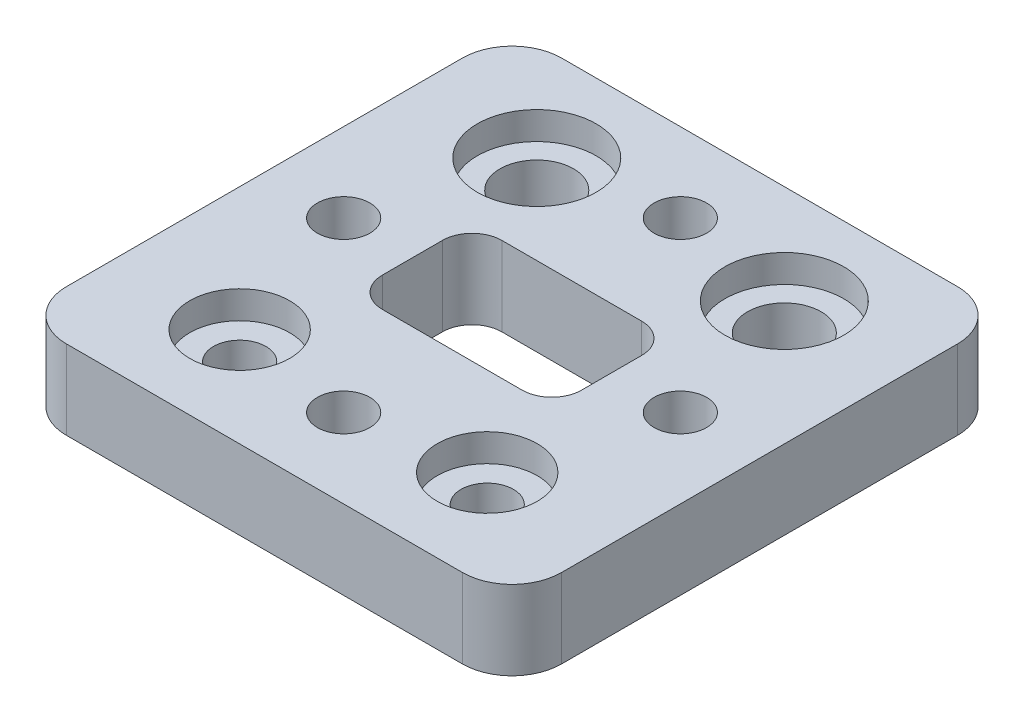
ISO-10303-21;
HEADER;
FILE_DESCRIPTION(('STEP AP214'),'2;1');
FILE_NAME('part.step','',(''),(''),'','','');
FILE_SCHEMA(('AUTOMOTIVE_DESIGN { 1 0 10303 214 1 1 1 1 }'));
ENDSEC;
DATA;
#1=APPLICATION_CONTEXT('core data for automotive mechanical design processes');
#2=APPLICATION_PROTOCOL_DEFINITION('international standard','automotive_design',2000,#1);
#3=PRODUCT_CONTEXT('',#1,'mechanical');
#4=PRODUCT('Part','Part','',(#3));
#5=PRODUCT_RELATED_PRODUCT_CATEGORY('part','',(#4));
#6=PRODUCT_DEFINITION_FORMATION('','',#4);
#7=PRODUCT_DEFINITION_CONTEXT('part definition',#1,'design');
#8=PRODUCT_DEFINITION('design','',#6,#7);
#9=PRODUCT_DEFINITION_SHAPE('','',#8);
#10=(LENGTH_UNIT() NAMED_UNIT(*) SI_UNIT(.MILLI.,.METRE.));
#11=(NAMED_UNIT(*) PLANE_ANGLE_UNIT() SI_UNIT($,.RADIAN.));
#12=(NAMED_UNIT(*) SI_UNIT($,.STERADIAN.) SOLID_ANGLE_UNIT());
#13=UNCERTAINTY_MEASURE_WITH_UNIT(LENGTH_MEASURE(1.E-05),#10,'distance_accuracy_value','');
#14=(GEOMETRIC_REPRESENTATION_CONTEXT(3) GLOBAL_UNCERTAINTY_ASSIGNED_CONTEXT((#13)) GLOBAL_UNIT_ASSIGNED_CONTEXT((#10,
#11,#12)) REPRESENTATION_CONTEXT('',''));
#15=CARTESIAN_POINT('',(0.,0.,0.));
#16=DIRECTION('',(0.,0.,1.));
#17=DIRECTION('',(1.,0.,0.));
#18=AXIS2_PLACEMENT_3D('',#15,#16,#17);
#19=CARTESIAN_POINT('',(-12.5,8.,15.));
#20=DIRECTION('',(0.,-1.,0.));
#21=DIRECTION('',(0.,0.,-1.));
#22=AXIS2_PLACEMENT_3D('',#19,#20,#21);
#23=CYLINDRICAL_SURFACE('',#22,2.65);
#24=CARTESIAN_POINT('',(-12.5,0.,15.));
#25=DIRECTION('',(0.,1.,0.));
#26=DIRECTION('',(0.,0.,1.));
#27=AXIS2_PLACEMENT_3D('',#24,#25,#26);
#28=CIRCLE('',#27,2.65);
#29=CARTESIAN_POINT('',(-12.5,0.,17.65));
#30=VERTEX_POINT('',#29);
#31=EDGE_CURVE('E266',#30,#30,#28,.T.);
#32=ORIENTED_EDGE('',*,*,#31,.F.);
#33=EDGE_LOOP('',(#32));
#34=FACE_BOUND('',#33,.T.);
#35=CARTESIAN_POINT('',(-12.5,5.2,15.));
#36=DIRECTION('',(0.,1.,0.));
#37=DIRECTION('',(0.,0.,1.));
#38=AXIS2_PLACEMENT_3D('',#35,#36,#37);
#39=CIRCLE('',#38,2.65);
#40=CARTESIAN_POINT('',(-12.5,5.2,17.65));
#41=VERTEX_POINT('',#40);
#42=EDGE_CURVE('E421',#41,#41,#39,.T.);
#43=ORIENTED_EDGE('',*,*,#42,.T.);
#44=EDGE_LOOP('',(#43));
#45=FACE_BOUND('',#44,.T.);
#46=ADVANCED_FACE('F58',(#34,#45),#23,.F.);
#47=CARTESIAN_POINT('',(12.5,8.,15.));
#48=DIRECTION('',(0.,-1.,0.));
#49=DIRECTION('',(0.,0.,-1.));
#50=AXIS2_PLACEMENT_3D('',#47,#48,#49);
#51=CYLINDRICAL_SURFACE('',#50,2.65);
#52=CARTESIAN_POINT('',(12.5,0.,15.));
#53=DIRECTION('',(0.,1.,0.));
#54=DIRECTION('',(0.,0.,1.));
#55=AXIS2_PLACEMENT_3D('',#52,#53,#54);
#56=CIRCLE('',#55,2.65);
#57=CARTESIAN_POINT('',(12.5,0.,17.65));
#58=VERTEX_POINT('',#57);
#59=EDGE_CURVE('E263',#58,#58,#56,.F.);
#60=ORIENTED_EDGE('',*,*,#59,.T.);
#61=EDGE_LOOP('',(#60));
#62=FACE_BOUND('',#61,.T.);
#63=CARTESIAN_POINT('',(12.5,5.2,15.));
#64=DIRECTION('',(0.,1.,0.));
#65=DIRECTION('',(0.,0.,1.));
#66=AXIS2_PLACEMENT_3D('',#63,#64,#65);
#67=CIRCLE('',#66,2.65);
#68=CARTESIAN_POINT('',(12.5,5.2,17.65));
#69=VERTEX_POINT('',#68);
#70=EDGE_CURVE('E416',#69,#69,#67,.T.);
#71=ORIENTED_EDGE('',*,*,#70,.T.);
#72=EDGE_LOOP('',(#71));
#73=FACE_BOUND('',#72,.T.);
#74=ADVANCED_FACE('F374',(#62,#73),#51,.F.);
#75=CARTESIAN_POINT('',(12.5,8.,-15.));
#76=DIRECTION('',(0.,-1.,0.));
#77=DIRECTION('',(0.,0.,-1.));
#78=AXIS2_PLACEMENT_3D('',#75,#76,#77);
#79=CYLINDRICAL_SURFACE('',#78,3.72000000000001);
#80=CARTESIAN_POINT('',(12.5,0.,-15.));
#81=DIRECTION('',(0.,1.,0.));
#82=DIRECTION('',(0.,0.,1.));
#83=AXIS2_PLACEMENT_3D('',#80,#81,#82);
#84=CIRCLE('',#83,3.72000000000001);
#85=CARTESIAN_POINT('',(12.5,0.,-11.28));
#86=VERTEX_POINT('',#85);
#87=EDGE_CURVE('E260',#86,#86,#84,.F.);
#88=ORIENTED_EDGE('',*,*,#87,.T.);
#89=EDGE_LOOP('',(#88));
#90=FACE_BOUND('',#89,.T.);
#91=CARTESIAN_POINT('',(12.5,5.2,-15.));
#92=DIRECTION('',(0.,1.,0.));
#93=DIRECTION('',(0.,0.,1.));
#94=AXIS2_PLACEMENT_3D('',#91,#92,#93);
#95=CIRCLE('',#94,3.72000000000001);
#96=CARTESIAN_POINT('',(12.5,5.2,-11.28));
#97=VERTEX_POINT('',#96);
#98=EDGE_CURVE('E398',#97,#97,#95,.T.);
#99=ORIENTED_EDGE('',*,*,#98,.T.);
#100=EDGE_LOOP('',(#99));
#101=FACE_BOUND('',#100,.T.);
#102=ADVANCED_FACE('F380',(#90,#101),#79,.F.);
#103=CARTESIAN_POINT('',(-12.5,8.,-15.));
#104=DIRECTION('',(0.,-1.,0.));
#105=DIRECTION('',(0.,0.,-1.));
#106=AXIS2_PLACEMENT_3D('',#103,#104,#105);
#107=CYLINDRICAL_SURFACE('',#106,3.72);
#108=CARTESIAN_POINT('',(-12.5,0.,-15.));
#109=DIRECTION('',(0.,1.,0.));
#110=DIRECTION('',(0.,0.,1.));
#111=AXIS2_PLACEMENT_3D('',#108,#109,#110);
#112=CIRCLE('',#111,3.72);
#113=CARTESIAN_POINT('',(-12.5,0.,-11.28));
#114=VERTEX_POINT('',#113);
#115=EDGE_CURVE('E269',#114,#114,#112,.T.);
#116=ORIENTED_EDGE('',*,*,#115,.F.);
#117=EDGE_LOOP('',(#116));
#118=FACE_BOUND('',#117,.T.);
#119=CARTESIAN_POINT('',(-12.5,5.2,-15.));
#120=DIRECTION('',(0.,1.,0.));
#121=DIRECTION('',(0.,0.,1.));
#122=AXIS2_PLACEMENT_3D('',#119,#120,#121);
#123=CIRCLE('',#122,3.72);
#124=CARTESIAN_POINT('',(-12.5,5.2,-11.28));
#125=VERTEX_POINT('',#124);
#126=EDGE_CURVE('E414',#125,#125,#123,.T.);
#127=ORIENTED_EDGE('',*,*,#126,.T.);
#128=EDGE_LOOP('',(#127));
#129=FACE_BOUND('',#128,.T.);
#130=ADVANCED_FACE('F386',(#118,#129),#107,.F.);
#131=CARTESIAN_POINT('',(-10.0602247248147,8.,0.));
#132=DIRECTION('',(-1.,0.,0.));
#133=DIRECTION('',(0.,0.,1.));
#134=AXIS2_PLACEMENT_3D('',#131,#132,#133);
#135=PLANE('',#134);
#136=DIRECTION('',(0.,0.,-1.));
#137=VECTOR('',#136,1.);
#138=CARTESIAN_POINT('',(-10.0602247248147,0.,0.));
#139=LINE('',#138,#137);
#140=CARTESIAN_POINT('',(-10.0602247248147,0.,3.03567090986811));
#141=VERTEX_POINT('',#140);
#142=CARTESIAN_POINT('',(-10.0602247248147,0.,-3.0356709098681));
#143=VERTEX_POINT('',#142);
#144=EDGE_CURVE('E242',#141,#143,#139,.T.);
#145=ORIENTED_EDGE('',*,*,#144,.T.);
#146=DIRECTION('',(0.,-1.,0.));
#147=VECTOR('',#146,1.);
#148=CARTESIAN_POINT('',(-10.0602247248147,8.,-3.0356709098681));
#149=LINE('',#148,#147);
#150=CARTESIAN_POINT('',(-10.0602247248147,8.,-3.0356709098681));
#151=VERTEX_POINT('',#150);
#152=EDGE_CURVE('E12',#151,#143,#149,.T.);
#153=ORIENTED_EDGE('',*,*,#152,.F.);
#154=DIRECTION('',(0.,0.,-1.));
#155=VECTOR('',#154,1.);
#156=CARTESIAN_POINT('',(-10.0602247248147,8.,0.));
#157=LINE('',#156,#155);
#158=CARTESIAN_POINT('',(-10.0602247248147,8.,3.03567090986811));
#159=VERTEX_POINT('',#158);
#160=EDGE_CURVE('E337',#159,#151,#157,.T.);
#161=ORIENTED_EDGE('',*,*,#160,.F.);
#162=DIRECTION('',(0.,-1.,0.));
#163=VECTOR('',#162,1.);
#164=CARTESIAN_POINT('',(-10.0602247248147,8.,3.03567090986811));
#165=LINE('',#164,#163);
#166=EDGE_CURVE('E273',#159,#141,#165,.T.);
#167=ORIENTED_EDGE('',*,*,#166,.T.);
#168=EDGE_LOOP('',(#145,#153,#161,#167));
#169=FACE_BOUND('',#168,.T.);
#170=ADVANCED_FACE('F354',(#169),#135,.F.);
#171=CARTESIAN_POINT('',(-7.06022472481465,8.,-3.03567090986813));
#172=DIRECTION('',(0.,-1.,0.));
#173=DIRECTION('',(0.,0.,-1.));
#174=AXIS2_PLACEMENT_3D('',#171,#172,#173);
#175=CYLINDRICAL_SURFACE('',#174,3.);
#176=CARTESIAN_POINT('',(-7.06022472481465,0.,-3.03567090986813));
#177=DIRECTION('',(0.,1.,0.));
#178=DIRECTION('',(0.,0.,1.));
#179=AXIS2_PLACEMENT_3D('',#176,#177,#178);
#180=CIRCLE('',#179,3.);
#181=CARTESIAN_POINT('',(-7.06022472481463,0.,-6.03567090986813));
#182=VERTEX_POINT('',#181);
#183=EDGE_CURVE('E245',#143,#182,#180,.F.);
#184=ORIENTED_EDGE('',*,*,#183,.T.);
#185=DIRECTION('',(0.,-1.,0.));
#186=VECTOR('',#185,1.);
#187=CARTESIAN_POINT('',(-7.06022472481463,8.,-6.03567090986813));
#188=LINE('',#187,#186);
#189=CARTESIAN_POINT('',(-7.06022472481463,8.,-6.03567090986813));
#190=VERTEX_POINT('',#189);
#191=EDGE_CURVE('E68',#190,#182,#188,.T.);
#192=ORIENTED_EDGE('',*,*,#191,.F.);
#193=CARTESIAN_POINT('',(-7.06022472481465,8.,-3.03567090986813));
#194=DIRECTION('',(0.,1.,0.));
#195=DIRECTION('',(0.,0.,1.));
#196=AXIS2_PLACEMENT_3D('',#193,#194,#195);
#197=CIRCLE('',#196,3.);
#198=EDGE_CURVE('E339',#151,#190,#197,.F.);
#199=ORIENTED_EDGE('',*,*,#198,.F.);
#200=ORIENTED_EDGE('',*,*,#152,.T.);
#201=EDGE_LOOP('',(#184,#192,#199,#200));
#202=FACE_BOUND('',#201,.T.);
#203=ADVANCED_FACE('F733',(#202),#175,.F.);
#204=CARTESIAN_POINT('',(0.,8.,-6.03567090986813));
#205=DIRECTION('',(0.,0.,-1.));
#206=DIRECTION('',(-1.,0.,0.));
#207=AXIS2_PLACEMENT_3D('',#204,#205,#206);
#208=PLANE('',#207);
#209=DIRECTION('',(1.,0.,0.));
#210=VECTOR('',#209,1.);
#211=CARTESIAN_POINT('',(0.,0.,-6.03567090986813));
#212=LINE('',#211,#210);
#213=CARTESIAN_POINT('',(7.06022472481462,0.,-6.03567090986813));
#214=VERTEX_POINT('',#213);
#215=EDGE_CURVE('E247',#182,#214,#212,.T.);
#216=ORIENTED_EDGE('',*,*,#215,.T.);
#217=DIRECTION('',(0.,-1.,0.));
#218=VECTOR('',#217,1.);
#219=CARTESIAN_POINT('',(7.06022472481462,8.,-6.03567090986813));
#220=LINE('',#219,#218);
#221=CARTESIAN_POINT('',(7.06022472481462,8.,-6.03567090986813));
#222=VERTEX_POINT('',#221);
#223=EDGE_CURVE('E279',#222,#214,#220,.T.);
#224=ORIENTED_EDGE('',*,*,#223,.F.);
#225=DIRECTION('',(1.,0.,0.));
#226=VECTOR('',#225,1.);
#227=CARTESIAN_POINT('',(0.,8.,-6.03567090986813));
#228=LINE('',#227,#226);
#229=EDGE_CURVE('E341',#190,#222,#228,.T.);
#230=ORIENTED_EDGE('',*,*,#229,.F.);
#231=ORIENTED_EDGE('',*,*,#191,.T.);
#232=EDGE_LOOP('',(#216,#224,#230,#231));
#233=FACE_BOUND('',#232,.T.);
#234=ADVANCED_FACE('F723',(#233),#208,.F.);
#235=CARTESIAN_POINT('',(7.06022472481465,8.,-3.03567090986813));
#236=DIRECTION('',(0.,-1.,0.));
#237=DIRECTION('',(0.,0.,-1.));
#238=AXIS2_PLACEMENT_3D('',#235,#236,#237);
#239=CYLINDRICAL_SURFACE('',#238,3.);
#240=CARTESIAN_POINT('',(7.06022472481465,0.,-3.03567090986813));
#241=DIRECTION('',(0.,1.,0.));
#242=DIRECTION('',(0.,0.,1.));
#243=AXIS2_PLACEMENT_3D('',#240,#241,#242);
#244=CIRCLE('',#243,3.);
#245=CARTESIAN_POINT('',(10.0602247248146,0.,-3.0356709098681));
#246=VERTEX_POINT('',#245);
#247=EDGE_CURVE('E250',#246,#214,#244,.T.);
#248=ORIENTED_EDGE('',*,*,#247,.F.);
#249=DIRECTION('',(0.,-1.,0.));
#250=VECTOR('',#249,1.);
#251=CARTESIAN_POINT('',(10.0602247248146,8.,-3.0356709098681));
#252=LINE('',#251,#250);
#253=CARTESIAN_POINT('',(10.0602247248146,8.,-3.0356709098681));
#254=VERTEX_POINT('',#253);
#255=EDGE_CURVE('E277',#254,#246,#252,.T.);
#256=ORIENTED_EDGE('',*,*,#255,.F.);
#257=CARTESIAN_POINT('',(7.06022472481465,8.,-3.03567090986813));
#258=DIRECTION('',(0.,1.,0.));
#259=DIRECTION('',(0.,0.,1.));
#260=AXIS2_PLACEMENT_3D('',#257,#258,#259);
#261=CIRCLE('',#260,3.);
#262=EDGE_CURVE('E343',#254,#222,#261,.T.);
#263=ORIENTED_EDGE('',*,*,#262,.T.);
#264=ORIENTED_EDGE('',*,*,#223,.T.);
#265=EDGE_LOOP('',(#248,#256,#263,#264));
#266=FACE_BOUND('',#265,.T.);
#267=ADVANCED_FACE('F714',(#266),#239,.F.);
#268=CARTESIAN_POINT('',(10.0602247248146,8.,0.));
#269=DIRECTION('',(-1.,0.,0.));
#270=DIRECTION('',(0.,0.,1.));
#271=AXIS2_PLACEMENT_3D('',#268,#269,#270);
#272=PLANE('',#271);
#273=DIRECTION('',(0.,0.,-1.));
#274=VECTOR('',#273,1.);
#275=CARTESIAN_POINT('',(10.0602247248146,0.,0.));
#276=LINE('',#275,#274);
#277=CARTESIAN_POINT('',(10.0602247248146,0.,3.03567090986811));
#278=VERTEX_POINT('',#277);
#279=EDGE_CURVE('E253',#278,#246,#276,.T.);
#280=ORIENTED_EDGE('',*,*,#279,.F.);
#281=DIRECTION('',(0.,-1.,0.));
#282=VECTOR('',#281,1.);
#283=CARTESIAN_POINT('',(10.0602247248146,8.,3.03567090986811));
#284=LINE('',#283,#282);
#285=CARTESIAN_POINT('',(10.0602247248146,8.,3.03567090986811));
#286=VERTEX_POINT('',#285);
#287=EDGE_CURVE('E190',#286,#278,#284,.T.);
#288=ORIENTED_EDGE('',*,*,#287,.F.);
#289=DIRECTION('',(0.,0.,-1.));
#290=VECTOR('',#289,1.);
#291=CARTESIAN_POINT('',(10.0602247248146,8.,0.));
#292=LINE('',#291,#290);
#293=EDGE_CURVE('E197',#286,#254,#292,.T.);
#294=ORIENTED_EDGE('',*,*,#293,.T.);
#295=ORIENTED_EDGE('',*,*,#255,.T.);
#296=EDGE_LOOP('',(#280,#288,#294,#295));
#297=FACE_BOUND('',#296,.T.);
#298=ADVANCED_FACE('F347',(#297),#272,.T.);
#299=CARTESIAN_POINT('',(7.06022472481465,8.,3.03567090986813));
#300=DIRECTION('',(0.,-1.,0.));
#301=DIRECTION('',(0.,0.,-1.));
#302=AXIS2_PLACEMENT_3D('',#299,#300,#301);
#303=CYLINDRICAL_SURFACE('',#302,3.);
#304=CARTESIAN_POINT('',(7.06022472481465,0.,3.03567090986813));
#305=DIRECTION('',(0.,1.,0.));
#306=DIRECTION('',(0.,0.,1.));
#307=AXIS2_PLACEMENT_3D('',#304,#305,#306);
#308=CIRCLE('',#307,3.);
#309=CARTESIAN_POINT('',(7.06022472481462,0.,6.03567090986813));
#310=VERTEX_POINT('',#309);
#311=EDGE_CURVE('E185',#310,#278,#308,.T.);
#312=ORIENTED_EDGE('',*,*,#311,.F.);
#313=DIRECTION('',(0.,-1.,0.));
#314=VECTOR('',#313,1.);
#315=CARTESIAN_POINT('',(7.06022472481462,8.,6.03567090986813));
#316=LINE('',#315,#314);
#317=CARTESIAN_POINT('',(7.06022472481462,8.,6.03567090986813));
#318=VERTEX_POINT('',#317);
#319=EDGE_CURVE('E180',#318,#310,#316,.T.);
#320=ORIENTED_EDGE('',*,*,#319,.F.);
#321=CARTESIAN_POINT('',(7.06022472481465,8.,3.03567090986813));
#322=DIRECTION('',(0.,1.,0.));
#323=DIRECTION('',(0.,0.,1.));
#324=AXIS2_PLACEMENT_3D('',#321,#322,#323);
#325=CIRCLE('',#324,3.);
#326=EDGE_CURVE('E183',#318,#286,#325,.T.);
#327=ORIENTED_EDGE('',*,*,#326,.T.);
#328=ORIENTED_EDGE('',*,*,#287,.T.);
#329=EDGE_LOOP('',(#312,#320,#327,#328));
#330=FACE_BOUND('',#329,.T.);
#331=ADVANCED_FACE('F182',(#330),#303,.F.);
#332=CARTESIAN_POINT('',(0.,8.,6.03567090986813));
#333=DIRECTION('',(0.,0.,-1.));
#334=DIRECTION('',(-1.,0.,0.));
#335=AXIS2_PLACEMENT_3D('',#332,#333,#334);
#336=PLANE('',#335);
#337=DIRECTION('',(1.,0.,0.));
#338=VECTOR('',#337,1.);
#339=CARTESIAN_POINT('',(0.,0.,6.03567090986813));
#340=LINE('',#339,#338);
#341=CARTESIAN_POINT('',(-7.06022472481463,0.,6.03567090986813));
#342=VERTEX_POINT('',#341);
#343=EDGE_CURVE('E257',#342,#310,#340,.T.);
#344=ORIENTED_EDGE('',*,*,#343,.F.);
#345=DIRECTION('',(0.,-1.,0.));
#346=VECTOR('',#345,1.);
#347=CARTESIAN_POINT('',(-7.06022472481463,8.,6.03567090986813));
#348=LINE('',#347,#346);
#349=CARTESIAN_POINT('',(-7.06022472481463,8.,6.03567090986813));
#350=VERTEX_POINT('',#349);
#351=EDGE_CURVE('E129',#350,#342,#348,.T.);
#352=ORIENTED_EDGE('',*,*,#351,.F.);
#353=DIRECTION('',(1.,0.,0.));
#354=VECTOR('',#353,1.);
#355=CARTESIAN_POINT('',(0.,8.,6.03567090986813));
#356=LINE('',#355,#354);
#357=EDGE_CURVE('E194',#350,#318,#356,.T.);
#358=ORIENTED_EDGE('',*,*,#357,.T.);
#359=ORIENTED_EDGE('',*,*,#319,.T.);
#360=EDGE_LOOP('',(#344,#352,#358,#359));
#361=FACE_BOUND('',#360,.T.);
#362=ADVANCED_FACE('F199',(#361),#336,.T.);
#363=CARTESIAN_POINT('',(-20.,8.,-20.));
#364=DIRECTION('',(0.,-1.,0.));
#365=DIRECTION('',(0.,0.,-1.));
#366=AXIS2_PLACEMENT_3D('',#363,#364,#365);
#367=CYLINDRICAL_SURFACE('',#366,5.);
#368=CARTESIAN_POINT('',(-20.,0.,-20.));
#369=DIRECTION('',(0.,1.,0.));
#370=DIRECTION('',(0.,0.,1.));
#371=AXIS2_PLACEMENT_3D('',#368,#369,#370);
#372=CIRCLE('',#371,5.);
#373=CARTESIAN_POINT('',(-25.,0.,-20.));
#374=VERTEX_POINT('',#373);
#375=CARTESIAN_POINT('',(-20.,0.,-25.));
#376=VERTEX_POINT('',#375);
#377=EDGE_CURVE('E218',#374,#376,#372,.F.);
#378=ORIENTED_EDGE('',*,*,#377,.F.);
#379=DIRECTION('',(0.,-1.,0.));
#380=VECTOR('',#379,1.);
#381=CARTESIAN_POINT('',(-25.,8.,-20.));
#382=LINE('',#381,#380);
#383=CARTESIAN_POINT('',(-25.,8.,-20.));
#384=VERTEX_POINT('',#383);
#385=EDGE_CURVE('E62',#384,#374,#382,.T.);
#386=ORIENTED_EDGE('',*,*,#385,.F.);
#387=CARTESIAN_POINT('',(-20.,8.,-20.));
#388=DIRECTION('',(0.,1.,0.));
#389=DIRECTION('',(0.,0.,1.));
#390=AXIS2_PLACEMENT_3D('',#387,#388,#389);
#391=CIRCLE('',#390,5.);
#392=CARTESIAN_POINT('',(-20.,8.,-25.));
#393=VERTEX_POINT('',#392);
#394=EDGE_CURVE('E324',#384,#393,#391,.F.);
#395=ORIENTED_EDGE('',*,*,#394,.T.);
#396=DIRECTION('',(0.,-1.,0.));
#397=VECTOR('',#396,1.);
#398=CARTESIAN_POINT('',(-20.,8.,-25.));
#399=LINE('',#398,#397);
#400=EDGE_CURVE('E201',#393,#376,#399,.T.);
#401=ORIENTED_EDGE('',*,*,#400,.T.);
#402=EDGE_LOOP('',(#378,#386,#395,#401));
#403=FACE_BOUND('',#402,.T.);
#404=ADVANCED_FACE('F304',(#403),#367,.T.);
#405=CARTESIAN_POINT('',(-25.,8.,0.));
#406=DIRECTION('',(-1.,0.,0.));
#407=DIRECTION('',(0.,0.,1.));
#408=AXIS2_PLACEMENT_3D('',#405,#406,#407);
#409=PLANE('',#408);
#410=DIRECTION('',(0.,0.,-1.));
#411=VECTOR('',#410,1.);
#412=CARTESIAN_POINT('',(-25.,0.,0.));
#413=LINE('',#412,#411);
#414=CARTESIAN_POINT('',(-25.,0.,20.));
#415=VERTEX_POINT('',#414);
#416=EDGE_CURVE('E221',#415,#374,#413,.T.);
#417=ORIENTED_EDGE('',*,*,#416,.F.);
#418=DIRECTION('',(0.,-1.,0.));
#419=VECTOR('',#418,1.);
#420=CARTESIAN_POINT('',(-25.,8.,20.));
#421=LINE('',#420,#419);
#422=CARTESIAN_POINT('',(-25.,8.,20.));
#423=VERTEX_POINT('',#422);
#424=EDGE_CURVE('E294',#423,#415,#421,.T.);
#425=ORIENTED_EDGE('',*,*,#424,.F.);
#426=DIRECTION('',(0.,0.,-1.));
#427=VECTOR('',#426,1.);
#428=CARTESIAN_POINT('',(-25.,8.,0.));
#429=LINE('',#428,#427);
#430=EDGE_CURVE('E303',#423,#384,#429,.T.);
#431=ORIENTED_EDGE('',*,*,#430,.T.);
#432=ORIENTED_EDGE('',*,*,#385,.T.);
#433=EDGE_LOOP('',(#417,#425,#431,#432));
#434=FACE_BOUND('',#433,.T.);
#435=ADVANCED_FACE('F301',(#434),#409,.T.);
#436=CARTESIAN_POINT('',(-20.,8.,20.));
#437=DIRECTION('',(0.,-1.,0.));
#438=DIRECTION('',(0.,0.,-1.));
#439=AXIS2_PLACEMENT_3D('',#436,#437,#438);
#440=CYLINDRICAL_SURFACE('',#439,5.);
#441=CARTESIAN_POINT('',(-20.,0.,20.));
#442=DIRECTION('',(0.,1.,0.));
#443=DIRECTION('',(0.,0.,1.));
#444=AXIS2_PLACEMENT_3D('',#441,#442,#443);
#445=CIRCLE('',#444,5.);
#446=CARTESIAN_POINT('',(-20.,0.,25.));
#447=VERTEX_POINT('',#446);
#448=EDGE_CURVE('E224',#447,#415,#445,.F.);
#449=ORIENTED_EDGE('',*,*,#448,.F.);
#450=DIRECTION('',(0.,-1.,0.));
#451=VECTOR('',#450,1.);
#452=CARTESIAN_POINT('',(-20.,8.,25.));
#453=LINE('',#452,#451);
#454=CARTESIAN_POINT('',(-20.,8.,25.));
#455=VERTEX_POINT('',#454);
#456=EDGE_CURVE('E293',#455,#447,#453,.T.);
#457=ORIENTED_EDGE('',*,*,#456,.F.);
#458=CARTESIAN_POINT('',(-20.,8.,20.));
#459=DIRECTION('',(0.,1.,0.));
#460=DIRECTION('',(0.,0.,1.));
#461=AXIS2_PLACEMENT_3D('',#458,#459,#460);
#462=CIRCLE('',#461,5.);
#463=EDGE_CURVE('E313',#455,#423,#462,.F.);
#464=ORIENTED_EDGE('',*,*,#463,.T.);
#465=ORIENTED_EDGE('',*,*,#424,.T.);
#466=EDGE_LOOP('',(#449,#457,#464,#465));
#467=FACE_BOUND('',#466,.T.);
#468=ADVANCED_FACE('F310',(#467),#440,.T.);
#469=CARTESIAN_POINT('',(0.,8.,25.));
#470=DIRECTION('',(0.,0.,-1.));
#471=DIRECTION('',(-1.,0.,0.));
#472=AXIS2_PLACEMENT_3D('',#469,#470,#471);
#473=PLANE('',#472);
#474=DIRECTION('',(1.,0.,0.));
#475=VECTOR('',#474,1.);
#476=CARTESIAN_POINT('',(0.,0.,25.));
#477=LINE('',#476,#475);
#478=CARTESIAN_POINT('',(20.,0.,25.));
#479=VERTEX_POINT('',#478);
#480=EDGE_CURVE('E227',#447,#479,#477,.T.);
#481=ORIENTED_EDGE('',*,*,#480,.T.);
#482=DIRECTION('',(0.,-1.,0.));
#483=VECTOR('',#482,1.);
#484=CARTESIAN_POINT('',(20.,8.,25.));
#485=LINE('',#484,#483);
#486=CARTESIAN_POINT('',(20.,8.,25.));
#487=VERTEX_POINT('',#486);
#488=EDGE_CURVE('E291',#487,#479,#485,.T.);
#489=ORIENTED_EDGE('',*,*,#488,.F.);
#490=DIRECTION('',(1.,0.,0.));
#491=VECTOR('',#490,1.);
#492=CARTESIAN_POINT('',(0.,8.,25.));
#493=LINE('',#492,#491);
#494=EDGE_CURVE('E316',#455,#487,#493,.T.);
#495=ORIENTED_EDGE('',*,*,#494,.F.);
#496=ORIENTED_EDGE('',*,*,#456,.T.);
#497=EDGE_LOOP('',(#481,#489,#495,#496));
#498=FACE_BOUND('',#497,.T.);
#499=ADVANCED_FACE('F317',(#498),#473,.F.);
#500=CARTESIAN_POINT('',(20.,8.,20.));
#501=DIRECTION('',(0.,-1.,0.));
#502=DIRECTION('',(0.,0.,-1.));
#503=AXIS2_PLACEMENT_3D('',#500,#501,#502);
#504=CYLINDRICAL_SURFACE('',#503,5.);
#505=CARTESIAN_POINT('',(20.,0.,20.));
#506=DIRECTION('',(0.,1.,0.));
#507=DIRECTION('',(0.,0.,1.));
#508=AXIS2_PLACEMENT_3D('',#505,#506,#507);
#509=CIRCLE('',#508,5.);
#510=CARTESIAN_POINT('',(25.,0.,20.));
#511=VERTEX_POINT('',#510);
#512=EDGE_CURVE('E230',#511,#479,#509,.F.);
#513=ORIENTED_EDGE('',*,*,#512,.F.);
#514=DIRECTION('',(0.,-1.,0.));
#515=VECTOR('',#514,1.);
#516=CARTESIAN_POINT('',(25.,8.,20.));
#517=LINE('',#516,#515);
#518=CARTESIAN_POINT('',(25.,8.,20.));
#519=VERTEX_POINT('',#518);
#520=EDGE_CURVE('E289',#519,#511,#517,.T.);
#521=ORIENTED_EDGE('',*,*,#520,.F.);
#522=CARTESIAN_POINT('',(20.,8.,20.));
#523=DIRECTION('',(0.,1.,0.));
#524=DIRECTION('',(0.,0.,1.));
#525=AXIS2_PLACEMENT_3D('',#522,#523,#524);
#526=CIRCLE('',#525,5.);
#527=EDGE_CURVE('E321',#519,#487,#526,.F.);
#528=ORIENTED_EDGE('',*,*,#527,.T.);
#529=ORIENTED_EDGE('',*,*,#488,.T.);
#530=EDGE_LOOP('',(#513,#521,#528,#529));
#531=FACE_BOUND('',#530,.T.);
#532=ADVANCED_FACE('F448',(#531),#504,.T.);
#533=CARTESIAN_POINT('',(25.,8.,0.));
#534=DIRECTION('',(-1.,0.,0.));
#535=DIRECTION('',(0.,0.,1.));
#536=AXIS2_PLACEMENT_3D('',#533,#534,#535);
#537=PLANE('',#536);
#538=DIRECTION('',(0.,0.,-1.));
#539=VECTOR('',#538,1.);
#540=CARTESIAN_POINT('',(25.,0.,0.));
#541=LINE('',#540,#539);
#542=CARTESIAN_POINT('',(25.,0.,-20.));
#543=VERTEX_POINT('',#542);
#544=EDGE_CURVE('E233',#511,#543,#541,.T.);
#545=ORIENTED_EDGE('',*,*,#544,.T.);
#546=DIRECTION('',(0.,-1.,0.));
#547=VECTOR('',#546,1.);
#548=CARTESIAN_POINT('',(25.,8.,-20.));
#549=LINE('',#548,#547);
#550=CARTESIAN_POINT('',(25.,8.,-20.));
#551=VERTEX_POINT('',#550);
#552=EDGE_CURVE('E286',#551,#543,#549,.T.);
#553=ORIENTED_EDGE('',*,*,#552,.F.);
#554=DIRECTION('',(0.,0.,-1.));
#555=VECTOR('',#554,1.);
#556=CARTESIAN_POINT('',(25.,8.,0.));
#557=LINE('',#556,#555);
#558=EDGE_CURVE('E329',#519,#551,#557,.T.);
#559=ORIENTED_EDGE('',*,*,#558,.F.);
#560=ORIENTED_EDGE('',*,*,#520,.T.);
#561=EDGE_LOOP('',(#545,#553,#559,#560));
#562=FACE_BOUND('',#561,.T.);
#563=ADVANCED_FACE('F368',(#562),#537,.F.);
#564=CARTESIAN_POINT('',(20.,8.,-20.));
#565=DIRECTION('',(0.,-1.,0.));
#566=DIRECTION('',(0.,0.,-1.));
#567=AXIS2_PLACEMENT_3D('',#564,#565,#566);
#568=CYLINDRICAL_SURFACE('',#567,5.);
#569=CARTESIAN_POINT('',(20.,0.,-20.));
#570=DIRECTION('',(0.,1.,0.));
#571=DIRECTION('',(0.,0.,1.));
#572=AXIS2_PLACEMENT_3D('',#569,#570,#571);
#573=CIRCLE('',#572,5.);
#574=CARTESIAN_POINT('',(20.,0.,-25.));
#575=VERTEX_POINT('',#574);
#576=EDGE_CURVE('E236',#543,#575,#573,.T.);
#577=ORIENTED_EDGE('',*,*,#576,.T.);
#578=DIRECTION('',(0.,-1.,0.));
#579=VECTOR('',#578,1.);
#580=CARTESIAN_POINT('',(20.,8.,-25.));
#581=LINE('',#580,#579);
#582=CARTESIAN_POINT('',(20.,8.,-25.));
#583=VERTEX_POINT('',#582);
#584=EDGE_CURVE('E284',#583,#575,#581,.T.);
#585=ORIENTED_EDGE('',*,*,#584,.F.);
#586=CARTESIAN_POINT('',(20.,8.,-20.));
#587=DIRECTION('',(0.,1.,0.));
#588=DIRECTION('',(0.,0.,1.));
#589=AXIS2_PLACEMENT_3D('',#586,#587,#588);
#590=CIRCLE('',#589,5.);
#591=EDGE_CURVE('E332',#551,#583,#590,.T.);
#592=ORIENTED_EDGE('',*,*,#591,.F.);
#593=ORIENTED_EDGE('',*,*,#552,.T.);
#594=EDGE_LOOP('',(#577,#585,#592,#593));
#595=FACE_BOUND('',#594,.T.);
#596=ADVANCED_FACE('F359',(#595),#568,.T.);
#597=CARTESIAN_POINT('',(-7.06022472481465,8.,3.03567090986813));
#598=DIRECTION('',(0.,-1.,0.));
#599=DIRECTION('',(0.,0.,-1.));
#600=AXIS2_PLACEMENT_3D('',#597,#598,#599);
#601=CYLINDRICAL_SURFACE('',#600,3.);
#602=CARTESIAN_POINT('',(-7.06022472481465,0.,3.03567090986813));
#603=DIRECTION('',(0.,1.,0.));
#604=DIRECTION('',(0.,0.,1.));
#605=AXIS2_PLACEMENT_3D('',#602,#603,#604);
#606=CIRCLE('',#605,3.);
#607=EDGE_CURVE('E132',#342,#141,#606,.F.);
#608=ORIENTED_EDGE('',*,*,#607,.T.);
#609=ORIENTED_EDGE('',*,*,#166,.F.);
#610=CARTESIAN_POINT('',(-7.06022472481465,8.,3.03567090986813));
#611=DIRECTION('',(0.,1.,0.));
#612=DIRECTION('',(0.,0.,1.));
#613=AXIS2_PLACEMENT_3D('',#610,#611,#612);
#614=CIRCLE('',#613,3.);
#615=EDGE_CURVE('E77',#350,#159,#614,.F.);
#616=ORIENTED_EDGE('',*,*,#615,.F.);
#617=ORIENTED_EDGE('',*,*,#351,.T.);
#618=EDGE_LOOP('',(#608,#609,#616,#617));
#619=FACE_BOUND('',#618,.T.);
#620=ADVANCED_FACE('F356',(#619),#601,.F.);
#621=CARTESIAN_POINT('',(0.,8.,-25.));
#622=DIRECTION('',(0.,0.,-1.));
#623=DIRECTION('',(-1.,0.,0.));
#624=AXIS2_PLACEMENT_3D('',#621,#622,#623);
#625=PLANE('',#624);
#626=DIRECTION('',(1.,0.,0.));
#627=VECTOR('',#626,1.);
#628=CARTESIAN_POINT('',(0.,0.,-25.));
#629=LINE('',#628,#627);
#630=EDGE_CURVE('E239',#376,#575,#629,.T.);
#631=ORIENTED_EDGE('',*,*,#630,.F.);
#632=ORIENTED_EDGE('',*,*,#400,.F.);
#633=DIRECTION('',(1.,0.,0.));
#634=VECTOR('',#633,1.);
#635=CARTESIAN_POINT('',(0.,8.,-25.));
#636=LINE('',#635,#634);
#637=EDGE_CURVE('E334',#393,#583,#636,.T.);
#638=ORIENTED_EDGE('',*,*,#637,.T.);
#639=ORIENTED_EDGE('',*,*,#584,.T.);
#640=EDGE_LOOP('',(#631,#632,#638,#639));
#641=FACE_BOUND('',#640,.T.);
#642=ADVANCED_FACE('F358',(#641),#625,.T.);
#643=CARTESIAN_POINT('',(0.,8.,17.));
#644=DIRECTION('',(0.,-1.,0.));
#645=DIRECTION('',(0.,0.,-1.));
#646=AXIS2_PLACEMENT_3D('',#643,#644,#645);
#647=CYLINDRICAL_SURFACE('',#646,2.65);
#648=CARTESIAN_POINT('',(0.,8.,17.));
#649=DIRECTION('',(0.,1.,0.));
#650=DIRECTION('',(0.,0.,1.));
#651=AXIS2_PLACEMENT_3D('',#648,#649,#650);
#652=CIRCLE('',#651,2.65);
#653=CARTESIAN_POINT('',(0.,8.,19.65));
#654=VERTEX_POINT('',#653);
#655=EDGE_CURVE('E438',#654,#654,#652,.T.);
#656=ORIENTED_EDGE('',*,*,#655,.T.);
#657=EDGE_LOOP('',(#656));
#658=FACE_BOUND('',#657,.T.);
#659=CARTESIAN_POINT('',(0.,0.,17.));
#660=DIRECTION('',(0.,1.,0.));
#661=DIRECTION('',(0.,0.,1.));
#662=AXIS2_PLACEMENT_3D('',#659,#660,#661);
#663=CIRCLE('',#662,2.65);
#664=CARTESIAN_POINT('',(0.,0.,19.65));
#665=VERTEX_POINT('',#664);
#666=EDGE_CURVE('E215',#665,#665,#663,.T.);
#667=ORIENTED_EDGE('',*,*,#666,.F.);
#668=EDGE_LOOP('',(#667));
#669=FACE_BOUND('',#668,.T.);
#670=ADVANCED_FACE('F365',(#658,#669),#647,.F.);
#671=CARTESIAN_POINT('',(-17.,8.,0.));
#672=DIRECTION('',(0.,-1.,0.));
#673=DIRECTION('',(0.,0.,-1.));
#674=AXIS2_PLACEMENT_3D('',#671,#672,#673);
#675=CYLINDRICAL_SURFACE('',#674,2.64999999999995);
#676=CARTESIAN_POINT('',(-17.,8.,0.));
#677=DIRECTION('',(0.,1.,0.));
#678=DIRECTION('',(0.,0.,1.));
#679=AXIS2_PLACEMENT_3D('',#676,#677,#678);
#680=CIRCLE('',#679,2.64999999999995);
#681=CARTESIAN_POINT('',(-17.,8.,2.64999999999994));
#682=VERTEX_POINT('',#681);
#683=EDGE_CURVE('E435',#682,#682,#680,.T.);
#684=ORIENTED_EDGE('',*,*,#683,.T.);
#685=EDGE_LOOP('',(#684));
#686=FACE_BOUND('',#685,.T.);
#687=CARTESIAN_POINT('',(-17.,0.,0.));
#688=DIRECTION('',(0.,1.,0.));
#689=DIRECTION('',(0.,0.,1.));
#690=AXIS2_PLACEMENT_3D('',#687,#688,#689);
#691=CIRCLE('',#690,2.64999999999995);
#692=CARTESIAN_POINT('',(-17.,0.,2.64999999999994));
#693=VERTEX_POINT('',#692);
#694=EDGE_CURVE('E212',#693,#693,#691,.T.);
#695=ORIENTED_EDGE('',*,*,#694,.F.);
#696=EDGE_LOOP('',(#695));
#697=FACE_BOUND('',#696,.T.);
#698=ADVANCED_FACE('F466',(#686,#697),#675,.F.);
#699=CARTESIAN_POINT('',(1.1697564204469E-13,8.,-17.));
#700=DIRECTION('',(0.,-1.,0.));
#701=DIRECTION('',(0.,0.,-1.));
#702=AXIS2_PLACEMENT_3D('',#699,#700,#701);
#703=CYLINDRICAL_SURFACE('',#702,2.65);
#704=CARTESIAN_POINT('',(1.1697564204469E-13,8.,-17.));
#705=DIRECTION('',(0.,1.,0.));
#706=DIRECTION('',(0.,0.,1.));
#707=AXIS2_PLACEMENT_3D('',#704,#705,#706);
#708=CIRCLE('',#707,2.65);
#709=CARTESIAN_POINT('',(1.1697564204469E-13,8.,-14.35));
#710=VERTEX_POINT('',#709);
#711=EDGE_CURVE('E432',#710,#710,#708,.T.);
#712=ORIENTED_EDGE('',*,*,#711,.T.);
#713=EDGE_LOOP('',(#712));
#714=FACE_BOUND('',#713,.T.);
#715=CARTESIAN_POINT('',(1.1697564204469E-13,0.,-17.));
#716=DIRECTION('',(0.,1.,0.));
#717=DIRECTION('',(0.,0.,1.));
#718=AXIS2_PLACEMENT_3D('',#715,#716,#717);
#719=CIRCLE('',#718,2.65);
#720=CARTESIAN_POINT('',(1.1697564204469E-13,0.,-14.35));
#721=VERTEX_POINT('',#720);
#722=EDGE_CURVE('E208',#721,#721,#719,.T.);
#723=ORIENTED_EDGE('',*,*,#722,.F.);
#724=EDGE_LOOP('',(#723));
#725=FACE_BOUND('',#724,.T.);
#726=ADVANCED_FACE('F469',(#714,#725),#703,.F.);
#727=CARTESIAN_POINT('',(17.,8.,0.));
#728=DIRECTION('',(0.,-1.,0.));
#729=DIRECTION('',(0.,0.,-1.));
#730=AXIS2_PLACEMENT_3D('',#727,#728,#729);
#731=CYLINDRICAL_SURFACE('',#730,2.64999999999983);
#732=CARTESIAN_POINT('',(17.,8.,0.));
#733=DIRECTION('',(0.,1.,0.));
#734=DIRECTION('',(0.,0.,1.));
#735=AXIS2_PLACEMENT_3D('',#732,#733,#734);
#736=CIRCLE('',#735,2.64999999999983);
#737=CARTESIAN_POINT('',(17.,8.,2.64999999999983));
#738=VERTEX_POINT('',#737);
#739=EDGE_CURVE('E272',#738,#738,#736,.T.);
#740=ORIENTED_EDGE('',*,*,#739,.T.);
#741=EDGE_LOOP('',(#740));
#742=FACE_BOUND('',#741,.T.);
#743=CARTESIAN_POINT('',(17.,0.,0.));
#744=DIRECTION('',(0.,1.,0.));
#745=DIRECTION('',(0.,0.,1.));
#746=AXIS2_PLACEMENT_3D('',#743,#744,#745);
#747=CIRCLE('',#746,2.64999999999983);
#748=CARTESIAN_POINT('',(17.,0.,2.64999999999983));
#749=VERTEX_POINT('',#748);
#750=EDGE_CURVE('E205',#749,#749,#747,.T.);
#751=ORIENTED_EDGE('',*,*,#750,.F.);
#752=EDGE_LOOP('',(#751));
#753=FACE_BOUND('',#752,.T.);
#754=ADVANCED_FACE('F60',(#742,#753),#731,.F.);
#755=CARTESIAN_POINT('',(0.,8.,0.));
#756=DIRECTION('',(0.,1.,0.));
#757=DIRECTION('',(0.,0.,1.));
#758=AXIS2_PLACEMENT_3D('',#755,#756,#757);
#759=PLANE('',#758);
#760=CARTESIAN_POINT('',(12.5,8.,15.));
#761=DIRECTION('',(0.,1.,0.));
#762=DIRECTION('',(0.,0.,1.));
#763=AXIS2_PLACEMENT_3D('',#760,#761,#762);
#764=CIRCLE('',#763,5.05000000000001);
#765=CARTESIAN_POINT('',(12.5,8.,20.05));
#766=VERTEX_POINT('',#765);
#767=EDGE_CURVE('E407',#766,#766,#764,.T.);
#768=ORIENTED_EDGE('',*,*,#767,.F.);
#769=EDGE_LOOP('',(#768));
#770=FACE_BOUND('',#769,.T.);
#771=CARTESIAN_POINT('',(12.5,8.,-15.));
#772=DIRECTION('',(0.,1.,0.));
#773=DIRECTION('',(0.,0.,1.));
#774=AXIS2_PLACEMENT_3D('',#771,#772,#773);
#775=CIRCLE('',#774,6.00000000000001);
#776=CARTESIAN_POINT('',(12.5,8.,-8.99999999999999));
#777=VERTEX_POINT('',#776);
#778=EDGE_CURVE('E400',#777,#777,#775,.T.);
#779=ORIENTED_EDGE('',*,*,#778,.F.);
#780=EDGE_LOOP('',(#779));
#781=FACE_BOUND('',#780,.T.);
#782=CARTESIAN_POINT('',(-12.5,8.,-15.));
#783=DIRECTION('',(0.,1.,0.));
#784=DIRECTION('',(0.,0.,1.));
#785=AXIS2_PLACEMENT_3D('',#782,#783,#784);
#786=CIRCLE('',#785,6.);
#787=CARTESIAN_POINT('',(-12.5,8.,-8.99999999999999));
#788=VERTEX_POINT('',#787);
#789=EDGE_CURVE('E411',#788,#788,#786,.T.);
#790=ORIENTED_EDGE('',*,*,#789,.F.);
#791=EDGE_LOOP('',(#790));
#792=FACE_BOUND('',#791,.T.);
#793=CARTESIAN_POINT('',(-12.5,8.,15.));
#794=DIRECTION('',(0.,1.,0.));
#795=DIRECTION('',(0.,0.,1.));
#796=AXIS2_PLACEMENT_3D('',#793,#794,#795);
#797=CIRCLE('',#796,5.05000000000001);
#798=CARTESIAN_POINT('',(-12.5,8.,20.05));
#799=VERTEX_POINT('',#798);
#800=EDGE_CURVE('E424',#799,#799,#797,.T.);
#801=ORIENTED_EDGE('',*,*,#800,.F.);
#802=EDGE_LOOP('',(#801));
#803=FACE_BOUND('',#802,.T.);
#804=ORIENTED_EDGE('',*,*,#739,.F.);
#805=EDGE_LOOP('',(#804));
#806=FACE_BOUND('',#805,.T.);
#807=ORIENTED_EDGE('',*,*,#711,.F.);
#808=EDGE_LOOP('',(#807));
#809=FACE_BOUND('',#808,.T.);
#810=ORIENTED_EDGE('',*,*,#683,.F.);
#811=EDGE_LOOP('',(#810));
#812=FACE_BOUND('',#811,.T.);
#813=ORIENTED_EDGE('',*,*,#655,.F.);
#814=EDGE_LOOP('',(#813));
#815=FACE_BOUND('',#814,.T.);
#816=ORIENTED_EDGE('',*,*,#394,.F.);
#817=ORIENTED_EDGE('',*,*,#430,.F.);
#818=ORIENTED_EDGE('',*,*,#463,.F.);
#819=ORIENTED_EDGE('',*,*,#494,.T.);
#820=ORIENTED_EDGE('',*,*,#527,.F.);
#821=ORIENTED_EDGE('',*,*,#558,.T.);
#822=ORIENTED_EDGE('',*,*,#591,.T.);
#823=ORIENTED_EDGE('',*,*,#637,.F.);
#824=EDGE_LOOP('',(#816,#817,#818,#819,#820,#821,#822,#823));
#825=FACE_BOUND('',#824,.T.);
#826=ORIENTED_EDGE('',*,*,#160,.T.);
#827=ORIENTED_EDGE('',*,*,#198,.T.);
#828=ORIENTED_EDGE('',*,*,#229,.T.);
#829=ORIENTED_EDGE('',*,*,#262,.F.);
#830=ORIENTED_EDGE('',*,*,#293,.F.);
#831=ORIENTED_EDGE('',*,*,#326,.F.);
#832=ORIENTED_EDGE('',*,*,#357,.F.);
#833=ORIENTED_EDGE('',*,*,#615,.T.);
#834=EDGE_LOOP('',(#826,#827,#828,#829,#830,#831,#832,#833));
#835=FACE_BOUND('',#834,.T.);
#836=ADVANCED_FACE('F193',(#770,#781,#792,#803,#806,#809,#812,#815,#825,#835),#759,.T.);
#837=CARTESIAN_POINT('',(0.,0.,0.));
#838=DIRECTION('',(0.,1.,0.));
#839=DIRECTION('',(0.,0.,1.));
#840=AXIS2_PLACEMENT_3D('',#837,#838,#839);
#841=PLANE('',#840);
#842=ORIENTED_EDGE('',*,*,#750,.T.);
#843=EDGE_LOOP('',(#842));
#844=FACE_BOUND('',#843,.T.);
#845=ORIENTED_EDGE('',*,*,#722,.T.);
#846=EDGE_LOOP('',(#845));
#847=FACE_BOUND('',#846,.T.);
#848=ORIENTED_EDGE('',*,*,#694,.T.);
#849=EDGE_LOOP('',(#848));
#850=FACE_BOUND('',#849,.T.);
#851=ORIENTED_EDGE('',*,*,#666,.T.);
#852=EDGE_LOOP('',(#851));
#853=FACE_BOUND('',#852,.T.);
#854=ORIENTED_EDGE('',*,*,#377,.T.);
#855=ORIENTED_EDGE('',*,*,#630,.T.);
#856=ORIENTED_EDGE('',*,*,#576,.F.);
#857=ORIENTED_EDGE('',*,*,#544,.F.);
#858=ORIENTED_EDGE('',*,*,#512,.T.);
#859=ORIENTED_EDGE('',*,*,#480,.F.);
#860=ORIENTED_EDGE('',*,*,#448,.T.);
#861=ORIENTED_EDGE('',*,*,#416,.T.);
#862=EDGE_LOOP('',(#854,#855,#856,#857,#858,#859,#860,#861));
#863=FACE_BOUND('',#862,.T.);
#864=ORIENTED_EDGE('',*,*,#144,.F.);
#865=ORIENTED_EDGE('',*,*,#607,.F.);
#866=ORIENTED_EDGE('',*,*,#343,.T.);
#867=ORIENTED_EDGE('',*,*,#311,.T.);
#868=ORIENTED_EDGE('',*,*,#279,.T.);
#869=ORIENTED_EDGE('',*,*,#247,.T.);
#870=ORIENTED_EDGE('',*,*,#215,.F.);
#871=ORIENTED_EDGE('',*,*,#183,.F.);
#872=EDGE_LOOP('',(#864,#865,#866,#867,#868,#869,#870,#871));
#873=FACE_BOUND('',#872,.T.);
#874=ORIENTED_EDGE('',*,*,#87,.F.);
#875=EDGE_LOOP('',(#874));
#876=FACE_BOUND('',#875,.T.);
#877=ORIENTED_EDGE('',*,*,#59,.F.);
#878=EDGE_LOOP('',(#877));
#879=FACE_BOUND('',#878,.T.);
#880=ORIENTED_EDGE('',*,*,#31,.T.);
#881=EDGE_LOOP('',(#880));
#882=FACE_BOUND('',#881,.T.);
#883=ORIENTED_EDGE('',*,*,#115,.T.);
#884=EDGE_LOOP('',(#883));
#885=FACE_BOUND('',#884,.T.);
#886=ADVANCED_FACE('F307',(#844,#847,#850,#853,#863,#873,#876,#879,#882,#885),#841,.F.);
#887=CARTESIAN_POINT('',(-12.5,5.2,15.));
#888=DIRECTION('',(0.,1.,0.));
#889=DIRECTION('',(0.,0.,1.));
#890=AXIS2_PLACEMENT_3D('',#887,#888,#889);
#891=CYLINDRICAL_SURFACE('',#890,5.05000000000001);
#892=CARTESIAN_POINT('',(-12.5,5.2,15.));
#893=DIRECTION('',(0.,1.,0.));
#894=DIRECTION('',(0.,0.,1.));
#895=AXIS2_PLACEMENT_3D('',#892,#893,#894);
#896=CIRCLE('',#895,5.05000000000001);
#897=CARTESIAN_POINT('',(-12.5,5.2,20.05));
#898=VERTEX_POINT('',#897);
#899=EDGE_CURVE('E209',#898,#898,#896,.T.);
#900=ORIENTED_EDGE('',*,*,#899,.F.);
#901=EDGE_LOOP('',(#900));
#902=FACE_BOUND('',#901,.T.);
#903=ORIENTED_EDGE('',*,*,#800,.T.);
#904=EDGE_LOOP('',(#903));
#905=FACE_BOUND('',#904,.T.);
#906=ADVANCED_FACE('F483',(#902,#905),#891,.F.);
#907=CARTESIAN_POINT('',(-12.5,5.2,15.));
#908=DIRECTION('',(0.,1.,0.));
#909=DIRECTION('',(0.,0.,1.));
#910=AXIS2_PLACEMENT_3D('',#907,#908,#909);
#911=PLANE('',#910);
#912=ORIENTED_EDGE('',*,*,#42,.F.);
#913=EDGE_LOOP('',(#912));
#914=FACE_BOUND('',#913,.T.);
#915=ORIENTED_EDGE('',*,*,#899,.T.);
#916=EDGE_LOOP('',(#915));
#917=FACE_BOUND('',#916,.T.);
#918=ADVANCED_FACE('F494',(#914,#917),#911,.T.);
#919=CARTESIAN_POINT('',(-12.5,5.2,-15.));
#920=DIRECTION('',(0.,1.,0.));
#921=DIRECTION('',(0.,0.,1.));
#922=AXIS2_PLACEMENT_3D('',#919,#920,#921);
#923=CYLINDRICAL_SURFACE('',#922,6.);
#924=CARTESIAN_POINT('',(-12.5,5.2,-15.));
#925=DIRECTION('',(0.,1.,0.));
#926=DIRECTION('',(0.,0.,1.));
#927=AXIS2_PLACEMENT_3D('',#924,#925,#926);
#928=CIRCLE('',#927,6.);
#929=CARTESIAN_POINT('',(-12.5,5.2,-8.99999999999999));
#930=VERTEX_POINT('',#929);
#931=EDGE_CURVE('E425',#930,#930,#928,.T.);
#932=ORIENTED_EDGE('',*,*,#931,.F.);
#933=EDGE_LOOP('',(#932));
#934=FACE_BOUND('',#933,.T.);
#935=ORIENTED_EDGE('',*,*,#789,.T.);
#936=EDGE_LOOP('',(#935));
#937=FACE_BOUND('',#936,.T.);
#938=ADVANCED_FACE('F502',(#934,#937),#923,.F.);
#939=CARTESIAN_POINT('',(-12.5,5.2,-15.));
#940=DIRECTION('',(0.,1.,0.));
#941=DIRECTION('',(0.,0.,1.));
#942=AXIS2_PLACEMENT_3D('',#939,#940,#941);
#943=PLANE('',#942);
#944=ORIENTED_EDGE('',*,*,#126,.F.);
#945=EDGE_LOOP('',(#944));
#946=FACE_BOUND('',#945,.T.);
#947=ORIENTED_EDGE('',*,*,#931,.T.);
#948=EDGE_LOOP('',(#947));
#949=FACE_BOUND('',#948,.T.);
#950=ADVANCED_FACE('F516',(#946,#949),#943,.T.);
#951=CARTESIAN_POINT('',(12.5,5.2,-15.));
#952=DIRECTION('',(0.,1.,0.));
#953=DIRECTION('',(0.,0.,1.));
#954=AXIS2_PLACEMENT_3D('',#951,#952,#953);
#955=CYLINDRICAL_SURFACE('',#954,6.00000000000001);
#956=CARTESIAN_POINT('',(12.5,5.2,-15.));
#957=DIRECTION('',(0.,1.,0.));
#958=DIRECTION('',(0.,0.,1.));
#959=AXIS2_PLACEMENT_3D('',#956,#957,#958);
#960=CIRCLE('',#959,6.00000000000001);
#961=CARTESIAN_POINT('',(12.5,5.2,-8.99999999999999));
#962=VERTEX_POINT('',#961);
#963=EDGE_CURVE('E404',#962,#962,#960,.T.);
#964=ORIENTED_EDGE('',*,*,#963,.F.);
#965=EDGE_LOOP('',(#964));
#966=FACE_BOUND('',#965,.T.);
#967=ORIENTED_EDGE('',*,*,#778,.T.);
#968=EDGE_LOOP('',(#967));
#969=FACE_BOUND('',#968,.T.);
#970=ADVANCED_FACE('F513',(#966,#969),#955,.F.);
#971=CARTESIAN_POINT('',(12.5,5.2,-15.));
#972=DIRECTION('',(0.,1.,0.));
#973=DIRECTION('',(0.,0.,1.));
#974=AXIS2_PLACEMENT_3D('',#971,#972,#973);
#975=PLANE('',#974);
#976=ORIENTED_EDGE('',*,*,#98,.F.);
#977=EDGE_LOOP('',(#976));
#978=FACE_BOUND('',#977,.T.);
#979=ORIENTED_EDGE('',*,*,#963,.T.);
#980=EDGE_LOOP('',(#979));
#981=FACE_BOUND('',#980,.T.);
#982=ADVANCED_FACE('F508',(#978,#981),#975,.T.);
#983=CARTESIAN_POINT('',(12.5,5.2,15.));
#984=DIRECTION('',(0.,1.,0.));
#985=DIRECTION('',(0.,0.,1.));
#986=AXIS2_PLACEMENT_3D('',#983,#984,#985);
#987=CYLINDRICAL_SURFACE('',#986,5.05000000000001);
#988=CARTESIAN_POINT('',(12.5,5.2,15.));
#989=DIRECTION('',(0.,1.,0.));
#990=DIRECTION('',(0.,0.,1.));
#991=AXIS2_PLACEMENT_3D('',#988,#989,#990);
#992=CIRCLE('',#991,5.05000000000001);
#993=CARTESIAN_POINT('',(12.5,5.2,20.05));
#994=VERTEX_POINT('',#993);
#995=EDGE_CURVE('E401',#994,#994,#992,.T.);
#996=ORIENTED_EDGE('',*,*,#995,.F.);
#997=EDGE_LOOP('',(#996));
#998=FACE_BOUND('',#997,.T.);
#999=ORIENTED_EDGE('',*,*,#767,.T.);
#1000=EDGE_LOOP('',(#999));
#1001=FACE_BOUND('',#1000,.T.);
#1002=ADVANCED_FACE('F504',(#998,#1001),#987,.F.);
#1003=CARTESIAN_POINT('',(12.5,5.2,15.));
#1004=DIRECTION('',(0.,1.,0.));
#1005=DIRECTION('',(0.,0.,1.));
#1006=AXIS2_PLACEMENT_3D('',#1003,#1004,#1005);
#1007=PLANE('',#1006);
#1008=ORIENTED_EDGE('',*,*,#70,.F.);
#1009=EDGE_LOOP('',(#1008));
#1010=FACE_BOUND('',#1009,.T.);
#1011=ORIENTED_EDGE('',*,*,#995,.T.);
#1012=EDGE_LOOP('',(#1011));
#1013=FACE_BOUND('',#1012,.T.);
#1014=ADVANCED_FACE('F507',(#1010,#1013),#1007,.T.);
#1015=CLOSED_SHELL('',(#46,#74,#102,#130,#170,#203,#234,#267,#298,#331,#362,#404,#435,#468,#499,
#532,#563,#596,#620,#642,#670,#698,#726,#754,#836,#886,#906,#918,#938,#950,#970,#982,#1002,#1014));
#1016=MANIFOLD_SOLID_BREP('B2',#1015);
#1017=ADVANCED_BREP_SHAPE_REPRESENTATION('',(#18,#1016),#14);
#1018=SHAPE_DEFINITION_REPRESENTATION(#9,#1017);
ENDSEC;
END-ISO-10303-21;
